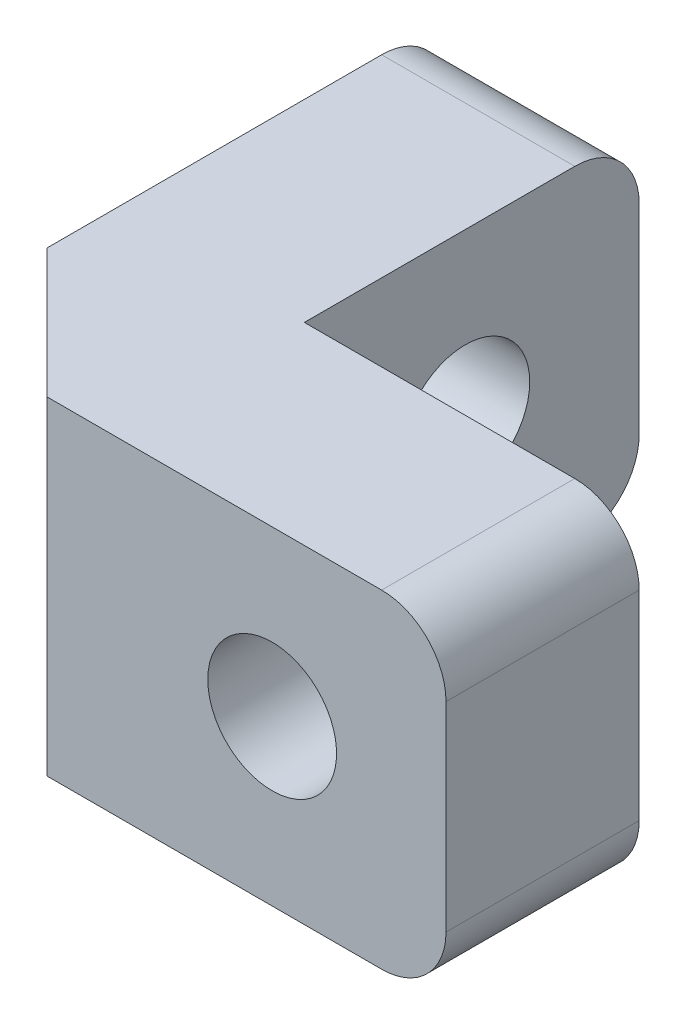
ISO-10303-21;
HEADER;
FILE_DESCRIPTION(('STEP AP214'),'2;1');
FILE_NAME('part.step','',(''),(''),'','','');
FILE_SCHEMA(('AUTOMOTIVE_DESIGN { 1 0 10303 214 1 1 1 1 }'));
ENDSEC;
DATA;
#1=APPLICATION_CONTEXT('core data for automotive mechanical design processes');
#2=APPLICATION_PROTOCOL_DEFINITION('international standard','automotive_design',2000,#1);
#3=PRODUCT_CONTEXT('',#1,'mechanical');
#4=PRODUCT('Part','Part','',(#3));
#5=PRODUCT_RELATED_PRODUCT_CATEGORY('part','',(#4));
#6=PRODUCT_DEFINITION_FORMATION('','',#4);
#7=PRODUCT_DEFINITION_CONTEXT('part definition',#1,'design');
#8=PRODUCT_DEFINITION('design','',#6,#7);
#9=PRODUCT_DEFINITION_SHAPE('','',#8);
#10=(LENGTH_UNIT() NAMED_UNIT(*) SI_UNIT(.MILLI.,.METRE.));
#11=(NAMED_UNIT(*) PLANE_ANGLE_UNIT() SI_UNIT($,.RADIAN.));
#12=(NAMED_UNIT(*) SI_UNIT($,.STERADIAN.) SOLID_ANGLE_UNIT());
#13=UNCERTAINTY_MEASURE_WITH_UNIT(LENGTH_MEASURE(1.E-05),#10,'distance_accuracy_value','');
#14=(GEOMETRIC_REPRESENTATION_CONTEXT(3) GLOBAL_UNCERTAINTY_ASSIGNED_CONTEXT((#13)) GLOBAL_UNIT_ASSIGNED_CONTEXT((#10,
#11,#12)) REPRESENTATION_CONTEXT('',''));
#15=CARTESIAN_POINT('',(0.,0.,0.));
#16=DIRECTION('',(0.,0.,1.));
#17=DIRECTION('',(1.,0.,0.));
#18=AXIS2_PLACEMENT_3D('',#15,#16,#17);
#19=CARTESIAN_POINT('',(-5.1,2.55,-2.5));
#20=DIRECTION('',(1.,0.,0.));
#21=DIRECTION('',(0.,0.,-1.));
#22=AXIS2_PLACEMENT_3D('',#19,#20,#21);
#23=CYLINDRICAL_SURFACE('',#22,1.);
#24=CARTESIAN_POINT('',(0.,2.55,-2.5));
#25=DIRECTION('',(1.,0.,0.));
#26=DIRECTION('',(0.,0.,-1.));
#27=AXIS2_PLACEMENT_3D('',#24,#25,#26);
#28=CIRCLE('',#27,1.);
#29=CARTESIAN_POINT('',(0.,2.55,-3.5));
#30=VERTEX_POINT('',#29);
#31=EDGE_CURVE('E194',#30,#30,#28,.T.);
#32=ORIENTED_EDGE('',*,*,#31,.T.);
#33=EDGE_LOOP('',(#32));
#34=FACE_BOUND('',#33,.T.);
#35=CARTESIAN_POINT('',(-1.6,2.55,-2.5));
#36=DIRECTION('',(-1.,0.,0.));
#37=DIRECTION('',(0.,0.,1.));
#38=AXIS2_PLACEMENT_3D('',#35,#36,#37);
#39=CIRCLE('',#38,1.);
#40=CARTESIAN_POINT('',(-1.6,2.55,-1.5));
#41=VERTEX_POINT('',#40);
#42=EDGE_CURVE('E40',#41,#41,#39,.F.);
#43=ORIENTED_EDGE('',*,*,#42,.F.);
#44=EDGE_LOOP('',(#43));
#45=FACE_BOUND('',#44,.T.);
#46=ADVANCED_FACE('F36',(#34,#45),#23,.F.);
#47=CARTESIAN_POINT('',(2.5,2.55,5.1));
#48=DIRECTION('',(0.,0.,-1.));
#49=DIRECTION('',(-1.,0.,0.));
#50=AXIS2_PLACEMENT_3D('',#47,#48,#49);
#51=CYLINDRICAL_SURFACE('',#50,1.);
#52=CARTESIAN_POINT('',(2.5,2.55,3.));
#53=DIRECTION('',(0.,0.,-1.));
#54=DIRECTION('',(-1.,0.,0.));
#55=AXIS2_PLACEMENT_3D('',#52,#53,#54);
#56=CIRCLE('',#55,1.);
#57=CARTESIAN_POINT('',(1.5,2.55,3.));
#58=VERTEX_POINT('',#57);
#59=EDGE_CURVE('E192',#58,#58,#56,.T.);
#60=ORIENTED_EDGE('',*,*,#59,.F.);
#61=EDGE_LOOP('',(#60));
#62=FACE_BOUND('',#61,.T.);
#63=CARTESIAN_POINT('',(2.5,2.55,1.4));
#64=DIRECTION('',(0.,0.,-1.));
#65=DIRECTION('',(-1.,0.,0.));
#66=AXIS2_PLACEMENT_3D('',#63,#64,#65);
#67=CIRCLE('',#66,1.);
#68=CARTESIAN_POINT('',(1.5,2.55,1.4));
#69=VERTEX_POINT('',#68);
#70=EDGE_CURVE('E195',#69,#69,#67,.F.);
#71=ORIENTED_EDGE('',*,*,#70,.F.);
#72=EDGE_LOOP('',(#71));
#73=FACE_BOUND('',#72,.T.);
#74=ADVANCED_FACE('F270',(#62,#73),#51,.F.);
#75=CARTESIAN_POINT('',(0.,5.1,0.));
#76=DIRECTION('',(0.,0.,1.));
#77=DIRECTION('',(1.,0.,0.));
#78=AXIS2_PLACEMENT_3D('',#75,#76,#77);
#79=PLANE('',#78);
#80=CARTESIAN_POINT('',(2.5,2.55,0.));
#81=DIRECTION('',(0.,0.,-1.));
#82=DIRECTION('',(-1.,0.,0.));
#83=AXIS2_PLACEMENT_3D('',#80,#81,#82);
#84=CIRCLE('',#83,1.7);
#85=CARTESIAN_POINT('',(0.8,2.55,0.));
#86=VERTEX_POINT('',#85);
#87=EDGE_CURVE('E201',#86,#86,#84,.T.);
#88=ORIENTED_EDGE('',*,*,#87,.F.);
#89=EDGE_LOOP('',(#88));
#90=FACE_BOUND('',#89,.T.);
#91=DIRECTION('',(0.,-1.,0.));
#92=VECTOR('',#91,1.);
#93=CARTESIAN_POINT('',(5.2,5.1,0.));
#94=LINE('',#93,#92);
#95=CARTESIAN_POINT('',(5.2,4.1,0.));
#96=VERTEX_POINT('',#95);
#97=CARTESIAN_POINT('',(5.2,1.,0.));
#98=VERTEX_POINT('',#97);
#99=EDGE_CURVE('E216',#96,#98,#94,.T.);
#100=ORIENTED_EDGE('',*,*,#99,.T.);
#101=CARTESIAN_POINT('',(4.2,1.,0.));
#102=DIRECTION('',(0.,0.,1.));
#103=DIRECTION('',(1.,0.,0.));
#104=AXIS2_PLACEMENT_3D('',#101,#102,#103);
#105=CIRCLE('',#104,1.);
#106=CARTESIAN_POINT('',(4.2,0.,0.));
#107=VERTEX_POINT('',#106);
#108=EDGE_CURVE('E170',#98,#107,#105,.F.);
#109=ORIENTED_EDGE('',*,*,#108,.T.);
#110=DIRECTION('',(-1.,0.,0.));
#111=VECTOR('',#110,1.);
#112=CARTESIAN_POINT('',(0.,0.,0.));
#113=LINE('',#112,#111);
#114=CARTESIAN_POINT('',(0.,0.,0.));
#115=VERTEX_POINT('',#114);
#116=EDGE_CURVE('E144',#107,#115,#113,.T.);
#117=ORIENTED_EDGE('',*,*,#116,.T.);
#118=DIRECTION('',(0.,-1.,0.));
#119=VECTOR('',#118,1.);
#120=CARTESIAN_POINT('',(0.,5.1,0.));
#121=LINE('',#120,#119);
#122=CARTESIAN_POINT('',(0.,5.1,0.));
#123=VERTEX_POINT('',#122);
#124=EDGE_CURVE('E137',#123,#115,#121,.T.);
#125=ORIENTED_EDGE('',*,*,#124,.F.);
#126=DIRECTION('',(-1.,0.,0.));
#127=VECTOR('',#126,1.);
#128=CARTESIAN_POINT('',(0.,5.1,0.));
#129=LINE('',#128,#127);
#130=CARTESIAN_POINT('',(4.2,5.1,0.));
#131=VERTEX_POINT('',#130);
#132=EDGE_CURVE('E122',#131,#123,#129,.T.);
#133=ORIENTED_EDGE('',*,*,#132,.F.);
#134=CARTESIAN_POINT('',(4.2,4.1,0.));
#135=DIRECTION('',(0.,0.,1.));
#136=DIRECTION('',(1.,0.,0.));
#137=AXIS2_PLACEMENT_3D('',#134,#135,#136);
#138=CIRCLE('',#137,1.);
#139=EDGE_CURVE('E168',#131,#96,#138,.F.);
#140=ORIENTED_EDGE('',*,*,#139,.T.);
#141=EDGE_LOOP('',(#100,#109,#117,#125,#133,#140));
#142=FACE_BOUND('',#141,.T.);
#143=ADVANCED_FACE('F142',(#90,#142),#79,.F.);
#144=CARTESIAN_POINT('',(0.,5.1,0.));
#145=DIRECTION('',(-1.,0.,0.));
#146=DIRECTION('',(0.,0.,1.));
#147=AXIS2_PLACEMENT_3D('',#144,#145,#146);
#148=PLANE('',#147);
#149=ORIENTED_EDGE('',*,*,#31,.F.);
#150=EDGE_LOOP('',(#149));
#151=FACE_BOUND('',#150,.T.);
#152=DIRECTION('',(0.,0.,-1.));
#153=VECTOR('',#152,1.);
#154=CARTESIAN_POINT('',(0.,0.,0.));
#155=LINE('',#154,#153);
#156=CARTESIAN_POINT('',(0.,0.,-4.2));
#157=VERTEX_POINT('',#156);
#158=EDGE_CURVE('E218',#115,#157,#155,.T.);
#159=ORIENTED_EDGE('',*,*,#158,.T.);
#160=CARTESIAN_POINT('',(0.,1.,-4.2));
#161=DIRECTION('',(-1.,0.,0.));
#162=DIRECTION('',(0.,0.,1.));
#163=AXIS2_PLACEMENT_3D('',#160,#161,#162);
#164=CIRCLE('',#163,1.);
#165=CARTESIAN_POINT('',(0.,1.,-5.2));
#166=VERTEX_POINT('',#165);
#167=EDGE_CURVE('E11',#157,#166,#164,.F.);
#168=ORIENTED_EDGE('',*,*,#167,.T.);
#169=DIRECTION('',(0.,-1.,0.));
#170=VECTOR('',#169,1.);
#171=CARTESIAN_POINT('',(0.,5.1,-5.2));
#172=LINE('',#171,#170);
#173=CARTESIAN_POINT('',(0.,4.1,-5.2));
#174=VERTEX_POINT('',#173);
#175=EDGE_CURVE('E147',#174,#166,#172,.T.);
#176=ORIENTED_EDGE('',*,*,#175,.F.);
#177=CARTESIAN_POINT('',(0.,4.1,-4.2));
#178=DIRECTION('',(-1.,0.,0.));
#179=DIRECTION('',(0.,0.,1.));
#180=AXIS2_PLACEMENT_3D('',#177,#178,#179);
#181=CIRCLE('',#180,1.);
#182=CARTESIAN_POINT('',(0.,5.1,-4.2));
#183=VERTEX_POINT('',#182);
#184=EDGE_CURVE('E45',#174,#183,#181,.F.);
#185=ORIENTED_EDGE('',*,*,#184,.T.);
#186=DIRECTION('',(0.,0.,-1.));
#187=VECTOR('',#186,1.);
#188=CARTESIAN_POINT('',(0.,5.1,0.));
#189=LINE('',#188,#187);
#190=EDGE_CURVE('E127',#123,#183,#189,.T.);
#191=ORIENTED_EDGE('',*,*,#190,.F.);
#192=ORIENTED_EDGE('',*,*,#124,.T.);
#193=EDGE_LOOP('',(#159,#168,#176,#185,#191,#192));
#194=FACE_BOUND('',#193,.T.);
#195=ADVANCED_FACE('F136',(#151,#194),#148,.F.);
#196=CARTESIAN_POINT('',(0.,5.1,-5.2));
#197=DIRECTION('',(0.,0.,1.));
#198=DIRECTION('',(1.,0.,0.));
#199=AXIS2_PLACEMENT_3D('',#196,#197,#198);
#200=PLANE('',#199);
#201=ORIENTED_EDGE('',*,*,#175,.T.);
#202=DIRECTION('',(-1.,0.,0.));
#203=VECTOR('',#202,1.);
#204=CARTESIAN_POINT('',(0.,1.,-5.2));
#205=LINE('',#204,#203);
#206=CARTESIAN_POINT('',(-3.,1.,-5.2));
#207=VERTEX_POINT('',#206);
#208=EDGE_CURVE('E184',#166,#207,#205,.T.);
#209=ORIENTED_EDGE('',*,*,#208,.T.);
#210=DIRECTION('',(0.,-1.,0.));
#211=VECTOR('',#210,1.);
#212=CARTESIAN_POINT('',(-3.,5.1,-5.2));
#213=LINE('',#212,#211);
#214=CARTESIAN_POINT('',(-3.,4.1,-5.2));
#215=VERTEX_POINT('',#214);
#216=EDGE_CURVE('E152',#215,#207,#213,.T.);
#217=ORIENTED_EDGE('',*,*,#216,.F.);
#218=DIRECTION('',(-1.,0.,0.));
#219=VECTOR('',#218,1.);
#220=CARTESIAN_POINT('',(0.,4.1,-5.2));
#221=LINE('',#220,#219);
#222=EDGE_CURVE('E58',#215,#174,#221,.F.);
#223=ORIENTED_EDGE('',*,*,#222,.T.);
#224=EDGE_LOOP('',(#201,#209,#217,#223));
#225=FACE_BOUND('',#224,.T.);
#226=ADVANCED_FACE('F232',(#225),#200,.F.);
#227=CARTESIAN_POINT('',(-3.,5.1,-5.2));
#228=DIRECTION('',(1.,0.,0.));
#229=DIRECTION('',(0.,0.,-1.));
#230=AXIS2_PLACEMENT_3D('',#227,#228,#229);
#231=PLANE('',#230);
#232=CARTESIAN_POINT('',(-3.,2.55,-2.5));
#233=DIRECTION('',(-1.,0.,0.));
#234=DIRECTION('',(0.,0.,1.));
#235=AXIS2_PLACEMENT_3D('',#232,#233,#234);
#236=CIRCLE('',#235,1.7);
#237=CARTESIAN_POINT('',(-3.,2.55,-0.8));
#238=VERTEX_POINT('',#237);
#239=EDGE_CURVE('E208',#238,#238,#236,.T.);
#240=ORIENTED_EDGE('',*,*,#239,.F.);
#241=EDGE_LOOP('',(#240));
#242=FACE_BOUND('',#241,.T.);
#243=ORIENTED_EDGE('',*,*,#216,.T.);
#244=CARTESIAN_POINT('',(-3.,1.,-4.2));
#245=DIRECTION('',(1.,0.,0.));
#246=DIRECTION('',(0.,0.,-1.));
#247=AXIS2_PLACEMENT_3D('',#244,#245,#246);
#248=CIRCLE('',#247,1.);
#249=CARTESIAN_POINT('',(-3.,0.,-4.2));
#250=VERTEX_POINT('',#249);
#251=EDGE_CURVE('E189',#207,#250,#248,.F.);
#252=ORIENTED_EDGE('',*,*,#251,.T.);
#253=DIRECTION('',(0.,0.,1.));
#254=VECTOR('',#253,1.);
#255=CARTESIAN_POINT('',(-3.,0.,-5.2));
#256=LINE('',#255,#254);
#257=CARTESIAN_POINT('',(-3.,0.,0.999999999999991));
#258=VERTEX_POINT('',#257);
#259=EDGE_CURVE('E220',#250,#258,#256,.T.);
#260=ORIENTED_EDGE('',*,*,#259,.T.);
#261=DIRECTION('',(0.,1.,0.));
#262=VECTOR('',#261,1.);
#263=CARTESIAN_POINT('',(-3.,5.1,0.999999999999991));
#264=LINE('',#263,#262);
#265=CARTESIAN_POINT('',(-3.,5.1,0.99999999999999));
#266=VERTEX_POINT('',#265);
#267=EDGE_CURVE('E158',#258,#266,#264,.T.);
#268=ORIENTED_EDGE('',*,*,#267,.T.);
#269=DIRECTION('',(0.,0.,1.));
#270=VECTOR('',#269,1.);
#271=CARTESIAN_POINT('',(-3.,5.1,-5.2));
#272=LINE('',#271,#270);
#273=CARTESIAN_POINT('',(-3.,5.1,-4.2));
#274=VERTEX_POINT('',#273);
#275=EDGE_CURVE('E139',#274,#266,#272,.T.);
#276=ORIENTED_EDGE('',*,*,#275,.F.);
#277=CARTESIAN_POINT('',(-3.,4.1,-4.2));
#278=DIRECTION('',(1.,0.,0.));
#279=DIRECTION('',(0.,0.,-1.));
#280=AXIS2_PLACEMENT_3D('',#277,#278,#279);
#281=CIRCLE('',#280,1.);
#282=EDGE_CURVE('E187',#274,#215,#281,.F.);
#283=ORIENTED_EDGE('',*,*,#282,.T.);
#284=EDGE_LOOP('',(#243,#252,#260,#268,#276,#283));
#285=FACE_BOUND('',#284,.T.);
#286=ADVANCED_FACE('F229',(#242,#285),#231,.F.);
#287=CARTESIAN_POINT('',(-3.,5.1,3.));
#288=DIRECTION('',(0.,0.,-1.));
#289=DIRECTION('',(-1.,0.,0.));
#290=AXIS2_PLACEMENT_3D('',#287,#288,#289);
#291=PLANE('',#290);
#292=ORIENTED_EDGE('',*,*,#59,.T.);
#293=EDGE_LOOP('',(#292));
#294=FACE_BOUND('',#293,.T.);
#295=DIRECTION('',(1.,0.,0.));
#296=VECTOR('',#295,1.);
#297=CARTESIAN_POINT('',(-3.,0.,3.));
#298=LINE('',#297,#296);
#299=CARTESIAN_POINT('',(-0.999999999999998,0.,3.));
#300=VERTEX_POINT('',#299);
#301=CARTESIAN_POINT('',(4.2,0.,3.));
#302=VERTEX_POINT('',#301);
#303=EDGE_CURVE('E133',#300,#302,#298,.T.);
#304=ORIENTED_EDGE('',*,*,#303,.T.);
#305=CARTESIAN_POINT('',(4.2,1.,3.));
#306=DIRECTION('',(0.,0.,-1.));
#307=DIRECTION('',(-1.,0.,0.));
#308=AXIS2_PLACEMENT_3D('',#305,#306,#307);
#309=CIRCLE('',#308,1.);
#310=CARTESIAN_POINT('',(5.2,1.,3.));
#311=VERTEX_POINT('',#310);
#312=EDGE_CURVE('E178',#302,#311,#309,.F.);
#313=ORIENTED_EDGE('',*,*,#312,.T.);
#314=DIRECTION('',(0.,-1.,0.));
#315=VECTOR('',#314,1.);
#316=CARTESIAN_POINT('',(5.2,5.1,3.));
#317=LINE('',#316,#315);
#318=CARTESIAN_POINT('',(5.2,4.1,3.));
#319=VERTEX_POINT('',#318);
#320=EDGE_CURVE('E225',#319,#311,#317,.T.);
#321=ORIENTED_EDGE('',*,*,#320,.F.);
#322=CARTESIAN_POINT('',(4.2,4.1,3.));
#323=DIRECTION('',(0.,0.,-1.));
#324=DIRECTION('',(-1.,0.,0.));
#325=AXIS2_PLACEMENT_3D('',#322,#323,#324);
#326=CIRCLE('',#325,1.);
#327=CARTESIAN_POINT('',(4.2,5.1,3.));
#328=VERTEX_POINT('',#327);
#329=EDGE_CURVE('E176',#319,#328,#326,.F.);
#330=ORIENTED_EDGE('',*,*,#329,.T.);
#331=DIRECTION('',(1.,0.,0.));
#332=VECTOR('',#331,1.);
#333=CARTESIAN_POINT('',(-3.,5.1,3.));
#334=LINE('',#333,#332);
#335=CARTESIAN_POINT('',(-0.999999999999998,5.1,3.));
#336=VERTEX_POINT('',#335);
#337=EDGE_CURVE('E214',#336,#328,#334,.T.);
#338=ORIENTED_EDGE('',*,*,#337,.F.);
#339=DIRECTION('',(0.,-1.,0.));
#340=VECTOR('',#339,1.);
#341=CARTESIAN_POINT('',(-0.999999999999998,5.1,3.));
#342=LINE('',#341,#340);
#343=EDGE_CURVE('E146',#336,#300,#342,.T.);
#344=ORIENTED_EDGE('',*,*,#343,.T.);
#345=EDGE_LOOP('',(#304,#313,#321,#330,#338,#344));
#346=FACE_BOUND('',#345,.T.);
#347=ADVANCED_FACE('F242',(#294,#346),#291,.F.);
#348=CARTESIAN_POINT('',(5.2,5.1,3.));
#349=DIRECTION('',(-1.,0.,0.));
#350=DIRECTION('',(0.,0.,1.));
#351=AXIS2_PLACEMENT_3D('',#348,#349,#350);
#352=PLANE('',#351);
#353=ORIENTED_EDGE('',*,*,#320,.T.);
#354=DIRECTION('',(0.,0.,-1.));
#355=VECTOR('',#354,1.);
#356=CARTESIAN_POINT('',(5.2,1.,3.));
#357=LINE('',#356,#355);
#358=EDGE_CURVE('E165',#311,#98,#357,.T.);
#359=ORIENTED_EDGE('',*,*,#358,.T.);
#360=ORIENTED_EDGE('',*,*,#99,.F.);
#361=DIRECTION('',(0.,0.,-1.));
#362=VECTOR('',#361,1.);
#363=CARTESIAN_POINT('',(5.2,4.1,3.));
#364=LINE('',#363,#362);
#365=EDGE_CURVE('E163',#96,#319,#364,.F.);
#366=ORIENTED_EDGE('',*,*,#365,.T.);
#367=EDGE_LOOP('',(#353,#359,#360,#366));
#368=FACE_BOUND('',#367,.T.);
#369=ADVANCED_FACE('F251',(#368),#352,.F.);
#370=CARTESIAN_POINT('',(0.,5.1,0.));
#371=DIRECTION('',(0.,1.,0.));
#372=DIRECTION('',(0.,0.,1.));
#373=AXIS2_PLACEMENT_3D('',#370,#371,#372);
#374=PLANE('',#373);
#375=ORIENTED_EDGE('',*,*,#337,.T.);
#376=DIRECTION('',(0.,0.,-1.));
#377=VECTOR('',#376,1.);
#378=CARTESIAN_POINT('',(4.2,5.1,0.));
#379=LINE('',#378,#377);
#380=EDGE_CURVE('E130',#328,#131,#379,.T.);
#381=ORIENTED_EDGE('',*,*,#380,.T.);
#382=ORIENTED_EDGE('',*,*,#132,.T.);
#383=ORIENTED_EDGE('',*,*,#190,.T.);
#384=DIRECTION('',(-1.,0.,0.));
#385=VECTOR('',#384,1.);
#386=CARTESIAN_POINT('',(-3.,5.1,-4.2));
#387=LINE('',#386,#385);
#388=EDGE_CURVE('E180',#183,#274,#387,.T.);
#389=ORIENTED_EDGE('',*,*,#388,.T.);
#390=ORIENTED_EDGE('',*,*,#275,.T.);
#391=DIRECTION('',(-0.707106781186546,0.,-0.707106781186549));
#392=VECTOR('',#391,1.);
#393=CARTESIAN_POINT('',(-2.,5.1,1.99999999999999));
#394=LINE('',#393,#392);
#395=EDGE_CURVE('E161',#266,#336,#394,.F.);
#396=ORIENTED_EDGE('',*,*,#395,.T.);
#397=EDGE_LOOP('',(#375,#381,#382,#383,#389,#390,#396));
#398=FACE_BOUND('',#397,.T.);
#399=ADVANCED_FACE('F125',(#398),#374,.T.);
#400=CARTESIAN_POINT('',(0.,0.,0.));
#401=DIRECTION('',(0.,1.,0.));
#402=DIRECTION('',(0.,0.,1.));
#403=AXIS2_PLACEMENT_3D('',#400,#401,#402);
#404=PLANE('',#403);
#405=ORIENTED_EDGE('',*,*,#116,.F.);
#406=DIRECTION('',(0.,0.,-1.));
#407=VECTOR('',#406,1.);
#408=CARTESIAN_POINT('',(4.2,0.,0.));
#409=LINE('',#408,#407);
#410=EDGE_CURVE('E174',#107,#302,#409,.F.);
#411=ORIENTED_EDGE('',*,*,#410,.T.);
#412=ORIENTED_EDGE('',*,*,#303,.F.);
#413=DIRECTION('',(0.707106781186546,0.,0.707106781186549));
#414=VECTOR('',#413,1.);
#415=CARTESIAN_POINT('',(-0.999999999999998,0.,3.));
#416=LINE('',#415,#414);
#417=EDGE_CURVE('E150',#300,#258,#416,.F.);
#418=ORIENTED_EDGE('',*,*,#417,.T.);
#419=ORIENTED_EDGE('',*,*,#259,.F.);
#420=DIRECTION('',(-1.,0.,0.));
#421=VECTOR('',#420,1.);
#422=CARTESIAN_POINT('',(0.,0.,-4.2));
#423=LINE('',#422,#421);
#424=EDGE_CURVE('E172',#250,#157,#423,.F.);
#425=ORIENTED_EDGE('',*,*,#424,.T.);
#426=ORIENTED_EDGE('',*,*,#158,.F.);
#427=EDGE_LOOP('',(#405,#411,#412,#418,#419,#425,#426));
#428=FACE_BOUND('',#427,.T.);
#429=ADVANCED_FACE('F258',(#428),#404,.F.);
#430=CARTESIAN_POINT('',(-0.999999999999998,5.1,3.));
#431=DIRECTION('',(0.707106781186549,0.,-0.707106781186546));
#432=DIRECTION('',(0.,-1.,0.));
#433=AXIS2_PLACEMENT_3D('',#430,#431,#432);
#434=PLANE('',#433);
#435=ORIENTED_EDGE('',*,*,#395,.F.);
#436=ORIENTED_EDGE('',*,*,#267,.F.);
#437=ORIENTED_EDGE('',*,*,#417,.F.);
#438=ORIENTED_EDGE('',*,*,#343,.F.);
#439=EDGE_LOOP('',(#435,#436,#437,#438));
#440=FACE_BOUND('',#439,.T.);
#441=ADVANCED_FACE('F239',(#440),#434,.F.);
#442=CARTESIAN_POINT('',(4.2,1.,3.));
#443=DIRECTION('',(0.,0.,-1.));
#444=DIRECTION('',(-1.,0.,0.));
#445=AXIS2_PLACEMENT_3D('',#442,#443,#444);
#446=CYLINDRICAL_SURFACE('',#445,1.);
#447=ORIENTED_EDGE('',*,*,#312,.F.);
#448=ORIENTED_EDGE('',*,*,#410,.F.);
#449=ORIENTED_EDGE('',*,*,#108,.F.);
#450=ORIENTED_EDGE('',*,*,#358,.F.);
#451=EDGE_LOOP('',(#447,#448,#449,#450));
#452=FACE_BOUND('',#451,.T.);
#453=ADVANCED_FACE('F255',(#452),#446,.T.);
#454=CARTESIAN_POINT('',(4.2,4.1,0.));
#455=DIRECTION('',(0.,0.,1.));
#456=DIRECTION('',(1.,0.,0.));
#457=AXIS2_PLACEMENT_3D('',#454,#455,#456);
#458=CYLINDRICAL_SURFACE('',#457,1.);
#459=ORIENTED_EDGE('',*,*,#329,.F.);
#460=ORIENTED_EDGE('',*,*,#365,.F.);
#461=ORIENTED_EDGE('',*,*,#139,.F.);
#462=ORIENTED_EDGE('',*,*,#380,.F.);
#463=EDGE_LOOP('',(#459,#460,#461,#462));
#464=FACE_BOUND('',#463,.T.);
#465=ADVANCED_FACE('F248',(#464),#458,.T.);
#466=CARTESIAN_POINT('',(0.,1.,-4.2));
#467=DIRECTION('',(-1.,0.,0.));
#468=DIRECTION('',(0.,0.,1.));
#469=AXIS2_PLACEMENT_3D('',#466,#467,#468);
#470=CYLINDRICAL_SURFACE('',#469,1.);
#471=ORIENTED_EDGE('',*,*,#167,.F.);
#472=ORIENTED_EDGE('',*,*,#424,.F.);
#473=ORIENTED_EDGE('',*,*,#251,.F.);
#474=ORIENTED_EDGE('',*,*,#208,.F.);
#475=EDGE_LOOP('',(#471,#472,#473,#474));
#476=FACE_BOUND('',#475,.T.);
#477=ADVANCED_FACE('F261',(#476),#470,.T.);
#478=CARTESIAN_POINT('',(0.,4.1,-4.2));
#479=DIRECTION('',(1.,0.,0.));
#480=DIRECTION('',(0.,0.,-1.));
#481=AXIS2_PLACEMENT_3D('',#478,#479,#480);
#482=CYLINDRICAL_SURFACE('',#481,1.);
#483=ORIENTED_EDGE('',*,*,#184,.F.);
#484=ORIENTED_EDGE('',*,*,#222,.F.);
#485=ORIENTED_EDGE('',*,*,#282,.F.);
#486=ORIENTED_EDGE('',*,*,#388,.F.);
#487=EDGE_LOOP('',(#483,#484,#485,#486));
#488=FACE_BOUND('',#487,.T.);
#489=ADVANCED_FACE('F38',(#488),#482,.T.);
#490=CARTESIAN_POINT('',(2.5,2.55,1.4));
#491=DIRECTION('',(0.,0.,-1.));
#492=DIRECTION('',(-1.,0.,0.));
#493=AXIS2_PLACEMENT_3D('',#490,#491,#492);
#494=PLANE('',#493);
#495=CARTESIAN_POINT('',(2.5,2.55,1.4));
#496=DIRECTION('',(0.,0.,-1.));
#497=DIRECTION('',(-1.,0.,0.));
#498=AXIS2_PLACEMENT_3D('',#495,#496,#497);
#499=CIRCLE('',#498,1.7);
#500=CARTESIAN_POINT('',(0.8,2.55,1.4));
#501=VERTEX_POINT('',#500);
#502=EDGE_CURVE('E197',#501,#501,#499,.T.);
#503=ORIENTED_EDGE('',*,*,#502,.T.);
#504=EDGE_LOOP('',(#503));
#505=FACE_BOUND('',#504,.T.);
#506=ORIENTED_EDGE('',*,*,#70,.T.);
#507=EDGE_LOOP('',(#506));
#508=FACE_BOUND('',#507,.T.);
#509=ADVANCED_FACE('F267',(#505,#508),#494,.T.);
#510=CARTESIAN_POINT('',(2.5,2.55,1.4));
#511=DIRECTION('',(0.,0.,-1.));
#512=DIRECTION('',(-1.,0.,0.));
#513=AXIS2_PLACEMENT_3D('',#510,#511,#512);
#514=CYLINDRICAL_SURFACE('',#513,1.7);
#515=ORIENTED_EDGE('',*,*,#502,.F.);
#516=EDGE_LOOP('',(#515));
#517=FACE_BOUND('',#516,.T.);
#518=ORIENTED_EDGE('',*,*,#87,.T.);
#519=EDGE_LOOP('',(#518));
#520=FACE_BOUND('',#519,.T.);
#521=ADVANCED_FACE('F359',(#517,#520),#514,.F.);
#522=CARTESIAN_POINT('',(-1.6,2.55,-2.5));
#523=DIRECTION('',(-1.,0.,0.));
#524=DIRECTION('',(0.,0.,1.));
#525=AXIS2_PLACEMENT_3D('',#522,#523,#524);
#526=PLANE('',#525);
#527=CARTESIAN_POINT('',(-1.6,2.55,-2.5));
#528=DIRECTION('',(-1.,0.,0.));
#529=DIRECTION('',(0.,0.,1.));
#530=AXIS2_PLACEMENT_3D('',#527,#528,#529);
#531=CIRCLE('',#530,1.7);
#532=CARTESIAN_POINT('',(-1.6,2.55,-0.8));
#533=VERTEX_POINT('',#532);
#534=EDGE_CURVE('E403',#533,#533,#531,.T.);
#535=ORIENTED_EDGE('',*,*,#534,.T.);
#536=EDGE_LOOP('',(#535));
#537=FACE_BOUND('',#536,.T.);
#538=ORIENTED_EDGE('',*,*,#42,.T.);
#539=EDGE_LOOP('',(#538));
#540=FACE_BOUND('',#539,.T.);
#541=ADVANCED_FACE('F367',(#537,#540),#526,.T.);
#542=CARTESIAN_POINT('',(-1.6,2.55,-2.5));
#543=DIRECTION('',(-1.,0.,0.));
#544=DIRECTION('',(0.,0.,1.));
#545=AXIS2_PLACEMENT_3D('',#542,#543,#544);
#546=CYLINDRICAL_SURFACE('',#545,1.7);
#547=ORIENTED_EDGE('',*,*,#534,.F.);
#548=EDGE_LOOP('',(#547));
#549=FACE_BOUND('',#548,.T.);
#550=ORIENTED_EDGE('',*,*,#239,.T.);
#551=EDGE_LOOP('',(#550));
#552=FACE_BOUND('',#551,.T.);
#553=ADVANCED_FACE('F386',(#549,#552),#546,.F.);
#554=CLOSED_SHELL('',(#46,#74,#143,#195,#226,#286,#347,#369,#399,#429,#441,#453,#465,#477,#489,
#509,#521,#541,#553));
#555=MANIFOLD_SOLID_BREP('B2',#554);
#556=ADVANCED_BREP_SHAPE_REPRESENTATION('',(#18,#555),#14);
#557=SHAPE_DEFINITION_REPRESENTATION(#9,#556);
ENDSEC;
END-ISO-10303-21;
